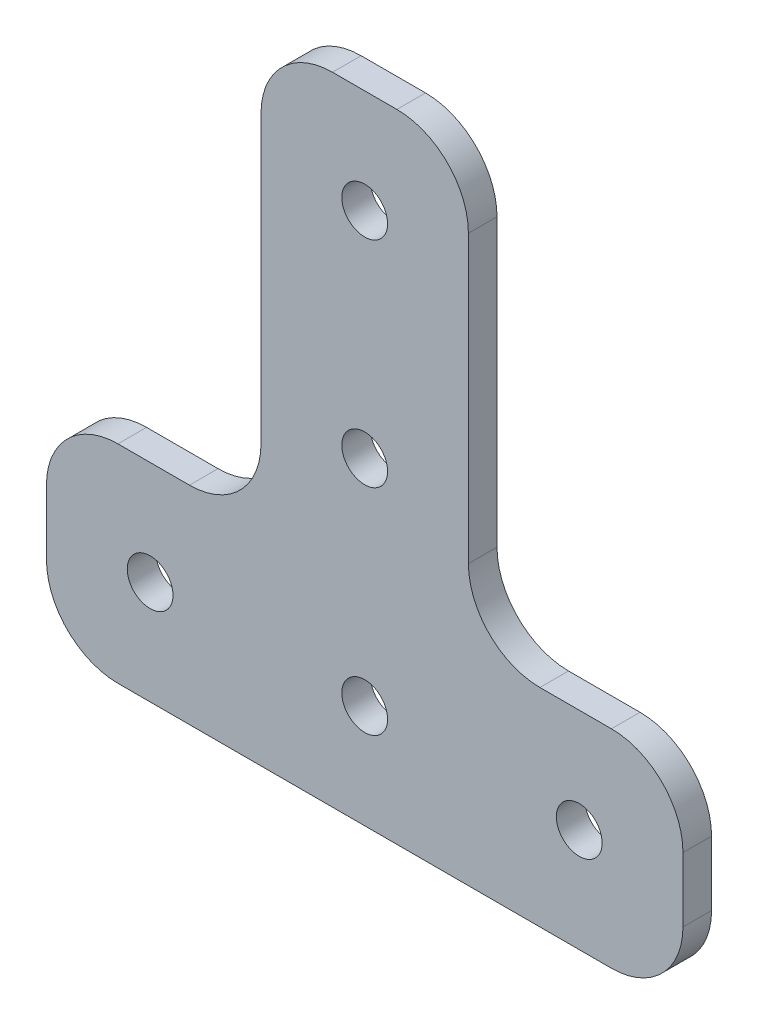
ISO-10303-21;
HEADER;
FILE_DESCRIPTION(('STEP AP214'),'2;1');
FILE_NAME('part.step','',(''),(''),'','','');
FILE_SCHEMA(('AUTOMOTIVE_DESIGN { 1 0 10303 214 1 1 1 1 }'));
ENDSEC;
DATA;
#1=APPLICATION_CONTEXT('core data for automotive mechanical design processes');
#2=APPLICATION_PROTOCOL_DEFINITION('international standard','automotive_design',2000,#1);
#3=PRODUCT_CONTEXT('',#1,'mechanical');
#4=PRODUCT('Part','Part','',(#3));
#5=PRODUCT_RELATED_PRODUCT_CATEGORY('part','',(#4));
#6=PRODUCT_DEFINITION_FORMATION('','',#4);
#7=PRODUCT_DEFINITION_CONTEXT('part definition',#1,'design');
#8=PRODUCT_DEFINITION('design','',#6,#7);
#9=PRODUCT_DEFINITION_SHAPE('','',#8);
#10=(LENGTH_UNIT() NAMED_UNIT(*) SI_UNIT(.MILLI.,.METRE.));
#11=(NAMED_UNIT(*) PLANE_ANGLE_UNIT() SI_UNIT($,.RADIAN.));
#12=(NAMED_UNIT(*) SI_UNIT($,.STERADIAN.) SOLID_ANGLE_UNIT());
#13=UNCERTAINTY_MEASURE_WITH_UNIT(LENGTH_MEASURE(1.E-05),#10,'distance_accuracy_value','');
#14=(GEOMETRIC_REPRESENTATION_CONTEXT(3) GLOBAL_UNCERTAINTY_ASSIGNED_CONTEXT((#13)) GLOBAL_UNIT_ASSIGNED_CONTEXT((#10,
#11,#12)) REPRESENTATION_CONTEXT('',''));
#15=CARTESIAN_POINT('',(0.,0.,0.));
#16=DIRECTION('',(0.,0.,1.));
#17=DIRECTION('',(1.,0.,0.));
#18=AXIS2_PLACEMENT_3D('',#15,#16,#17);
#19=CARTESIAN_POINT('',(0.,0.,2.));
#20=DIRECTION('',(0.,0.,1.));
#21=DIRECTION('',(1.,0.,0.));
#22=AXIS2_PLACEMENT_3D('',#19,#20,#21);
#23=PLANE('',#22);
#24=CARTESIAN_POINT('',(0.,37.25,2.));
#25=DIRECTION('',(0.,0.,1.));
#26=DIRECTION('',(1.,0.,0.));
#27=AXIS2_PLACEMENT_3D('',#24,#25,#26);
#28=CIRCLE('',#27,1.6);
#29=CARTESIAN_POINT('',(1.6,37.25,2.));
#30=VERTEX_POINT('',#29);
#31=EDGE_CURVE('E541',#30,#30,#28,.T.);
#32=ORIENTED_EDGE('',*,*,#31,.F.);
#33=EDGE_LOOP('',(#32));
#34=FACE_BOUND('',#33,.T.);
#35=CARTESIAN_POINT('',(15.,7.25,2.));
#36=DIRECTION('',(0.,0.,1.));
#37=DIRECTION('',(1.,0.,0.));
#38=AXIS2_PLACEMENT_3D('',#35,#36,#37);
#39=CIRCLE('',#38,1.6);
#40=CARTESIAN_POINT('',(16.6,7.25,2.));
#41=VERTEX_POINT('',#40);
#42=EDGE_CURVE('E521',#41,#41,#39,.T.);
#43=ORIENTED_EDGE('',*,*,#42,.F.);
#44=EDGE_LOOP('',(#43));
#45=FACE_BOUND('',#44,.T.);
#46=DIRECTION('',(-1.,0.,0.));
#47=VECTOR('',#46,1.);
#48=CARTESIAN_POINT('',(-7.24999999999999,44.5,2.));
#49=LINE('',#48,#47);
#50=CARTESIAN_POINT('',(2.25,44.5,2.));
#51=VERTEX_POINT('',#50);
#52=CARTESIAN_POINT('',(-2.24999999999999,44.5,2.));
#53=VERTEX_POINT('',#52);
#54=EDGE_CURVE('E280',#51,#53,#49,.T.);
#55=ORIENTED_EDGE('',*,*,#54,.T.);
#56=CARTESIAN_POINT('',(-2.24999999999999,39.5,2.));
#57=DIRECTION('',(0.,0.,1.));
#58=DIRECTION('',(1.,0.,0.));
#59=AXIS2_PLACEMENT_3D('',#56,#57,#58);
#60=CIRCLE('',#59,5.);
#61=CARTESIAN_POINT('',(-7.24999999999999,39.5,2.));
#62=VERTEX_POINT('',#61);
#63=EDGE_CURVE('E239',#53,#62,#60,.T.);
#64=ORIENTED_EDGE('',*,*,#63,.T.);
#65=DIRECTION('',(0.,-1.,0.));
#66=VECTOR('',#65,1.);
#67=CARTESIAN_POINT('',(-7.24999999999999,44.5,2.));
#68=LINE('',#67,#66);
#69=CARTESIAN_POINT('',(-7.25,19.5,2.));
#70=VERTEX_POINT('',#69);
#71=EDGE_CURVE('E271',#62,#70,#68,.T.);
#72=ORIENTED_EDGE('',*,*,#71,.T.);
#73=CARTESIAN_POINT('',(-12.25,19.5,2.));
#74=DIRECTION('',(0.,0.,1.));
#75=DIRECTION('',(1.,0.,0.));
#76=AXIS2_PLACEMENT_3D('',#73,#74,#75);
#77=CIRCLE('',#76,5.);
#78=CARTESIAN_POINT('',(-12.25,14.5,2.));
#79=VERTEX_POINT('',#78);
#80=EDGE_CURVE('E11',#70,#79,#77,.F.);
#81=ORIENTED_EDGE('',*,*,#80,.T.);
#82=DIRECTION('',(-1.,0.,0.));
#83=VECTOR('',#82,1.);
#84=CARTESIAN_POINT('',(-22.25,14.5,2.));
#85=LINE('',#84,#83);
#86=CARTESIAN_POINT('',(-17.25,14.5,2.));
#87=VERTEX_POINT('',#86);
#88=EDGE_CURVE('E269',#79,#87,#85,.T.);
#89=ORIENTED_EDGE('',*,*,#88,.T.);
#90=CARTESIAN_POINT('',(-17.25,9.5,2.));
#91=DIRECTION('',(0.,0.,1.));
#92=DIRECTION('',(1.,0.,0.));
#93=AXIS2_PLACEMENT_3D('',#90,#91,#92);
#94=CIRCLE('',#93,5.);
#95=CARTESIAN_POINT('',(-22.25,9.5,2.));
#96=VERTEX_POINT('',#95);
#97=EDGE_CURVE('E230',#87,#96,#94,.T.);
#98=ORIENTED_EDGE('',*,*,#97,.T.);
#99=DIRECTION('',(0.,-1.,0.));
#100=VECTOR('',#99,1.);
#101=CARTESIAN_POINT('',(-22.25,0.,2.));
#102=LINE('',#101,#100);
#103=CARTESIAN_POINT('',(-22.25,5.,2.));
#104=VERTEX_POINT('',#103);
#105=EDGE_CURVE('E275',#96,#104,#102,.T.);
#106=ORIENTED_EDGE('',*,*,#105,.T.);
#107=CARTESIAN_POINT('',(-17.25,5.,2.));
#108=DIRECTION('',(0.,0.,1.));
#109=DIRECTION('',(1.,0.,0.));
#110=AXIS2_PLACEMENT_3D('',#107,#108,#109);
#111=CIRCLE('',#110,5.);
#112=CARTESIAN_POINT('',(-17.25,0.,2.));
#113=VERTEX_POINT('',#112);
#114=EDGE_CURVE('E232',#104,#113,#111,.T.);
#115=ORIENTED_EDGE('',*,*,#114,.T.);
#116=DIRECTION('',(1.,0.,0.));
#117=VECTOR('',#116,1.);
#118=CARTESIAN_POINT('',(-22.25,0.,2.));
#119=LINE('',#118,#117);
#120=CARTESIAN_POINT('',(17.25,0.,2.));
#121=VERTEX_POINT('',#120);
#122=EDGE_CURVE('E278',#113,#121,#119,.T.);
#123=ORIENTED_EDGE('',*,*,#122,.T.);
#124=CARTESIAN_POINT('',(17.25,5.,2.));
#125=DIRECTION('',(0.,0.,1.));
#126=DIRECTION('',(1.,0.,0.));
#127=AXIS2_PLACEMENT_3D('',#124,#125,#126);
#128=CIRCLE('',#127,5.);
#129=CARTESIAN_POINT('',(22.25,5.,2.));
#130=VERTEX_POINT('',#129);
#131=EDGE_CURVE('E54',#121,#130,#128,.T.);
#132=ORIENTED_EDGE('',*,*,#131,.T.);
#133=DIRECTION('',(0.,1.,0.));
#134=VECTOR('',#133,1.);
#135=CARTESIAN_POINT('',(22.25,0.,2.));
#136=LINE('',#135,#134);
#137=CARTESIAN_POINT('',(22.25,9.5,2.));
#138=VERTEX_POINT('',#137);
#139=EDGE_CURVE('E199',#130,#138,#136,.T.);
#140=ORIENTED_EDGE('',*,*,#139,.T.);
#141=CARTESIAN_POINT('',(17.25,9.5,2.));
#142=DIRECTION('',(0.,0.,1.));
#143=DIRECTION('',(1.,0.,0.));
#144=AXIS2_PLACEMENT_3D('',#141,#142,#143);
#145=CIRCLE('',#144,5.);
#146=CARTESIAN_POINT('',(17.25,14.5,2.));
#147=VERTEX_POINT('',#146);
#148=EDGE_CURVE('E234',#138,#147,#145,.T.);
#149=ORIENTED_EDGE('',*,*,#148,.T.);
#150=DIRECTION('',(-1.,0.,0.));
#151=VECTOR('',#150,1.);
#152=CARTESIAN_POINT('',(7.25000000000001,14.5,2.));
#153=LINE('',#152,#151);
#154=CARTESIAN_POINT('',(12.25,14.5,2.));
#155=VERTEX_POINT('',#154);
#156=EDGE_CURVE('E198',#147,#155,#153,.T.);
#157=ORIENTED_EDGE('',*,*,#156,.T.);
#158=CARTESIAN_POINT('',(12.25,19.5,2.));
#159=DIRECTION('',(0.,0.,1.));
#160=DIRECTION('',(1.,0.,0.));
#161=AXIS2_PLACEMENT_3D('',#158,#159,#160);
#162=CIRCLE('',#161,5.);
#163=CARTESIAN_POINT('',(7.25000000000001,19.5,2.));
#164=VERTEX_POINT('',#163);
#165=EDGE_CURVE('E156',#155,#164,#162,.F.);
#166=ORIENTED_EDGE('',*,*,#165,.T.);
#167=DIRECTION('',(0.,1.,0.));
#168=VECTOR('',#167,1.);
#169=CARTESIAN_POINT('',(7.25,44.5,2.));
#170=LINE('',#169,#168);
#171=CARTESIAN_POINT('',(7.25,39.5,2.));
#172=VERTEX_POINT('',#171);
#173=EDGE_CURVE('E166',#164,#172,#170,.T.);
#174=ORIENTED_EDGE('',*,*,#173,.T.);
#175=CARTESIAN_POINT('',(2.25,39.5,2.));
#176=DIRECTION('',(0.,0.,1.));
#177=DIRECTION('',(1.,0.,0.));
#178=AXIS2_PLACEMENT_3D('',#175,#176,#177);
#179=CIRCLE('',#178,5.);
#180=EDGE_CURVE('E237',#172,#51,#179,.T.);
#181=ORIENTED_EDGE('',*,*,#180,.T.);
#182=EDGE_LOOP('',(#55,#64,#72,#81,#89,#98,#106,#115,#123,#132,#140,#149,#157,#166,#174,#181));
#183=FACE_BOUND('',#182,.T.);
#184=CARTESIAN_POINT('',(0.,7.25,2.));
#185=DIRECTION('',(0.,0.,1.));
#186=DIRECTION('',(1.,0.,0.));
#187=AXIS2_PLACEMENT_3D('',#184,#185,#186);
#188=CIRCLE('',#187,1.6);
#189=CARTESIAN_POINT('',(1.60000000000001,7.25,2.));
#190=VERTEX_POINT('',#189);
#191=EDGE_CURVE('E181',#190,#190,#188,.T.);
#192=ORIENTED_EDGE('',*,*,#191,.F.);
#193=EDGE_LOOP('',(#192));
#194=FACE_BOUND('',#193,.T.);
#195=CARTESIAN_POINT('',(0.,22.25,2.));
#196=DIRECTION('',(0.,0.,1.));
#197=DIRECTION('',(1.,0.,0.));
#198=AXIS2_PLACEMENT_3D('',#195,#196,#197);
#199=CIRCLE('',#198,1.6);
#200=CARTESIAN_POINT('',(1.60000000000001,22.25,2.));
#201=VERTEX_POINT('',#200);
#202=EDGE_CURVE('E536',#201,#201,#199,.T.);
#203=ORIENTED_EDGE('',*,*,#202,.F.);
#204=EDGE_LOOP('',(#203));
#205=FACE_BOUND('',#204,.T.);
#206=CARTESIAN_POINT('',(-15.,7.25,2.));
#207=DIRECTION('',(0.,0.,1.));
#208=DIRECTION('',(-1.,0.,0.));
#209=AXIS2_PLACEMENT_3D('',#206,#207,#208);
#210=CIRCLE('',#209,1.6);
#211=CARTESIAN_POINT('',(-16.6,7.25,2.));
#212=VERTEX_POINT('',#211);
#213=EDGE_CURVE('E547',#212,#212,#210,.T.);
#214=ORIENTED_EDGE('',*,*,#213,.F.);
#215=EDGE_LOOP('',(#214));
#216=FACE_BOUND('',#215,.T.);
#217=ADVANCED_FACE('F32',(#34,#45,#183,#194,#205,#216),#23,.T.);
#218=CARTESIAN_POINT('',(0.,0.,0.));
#219=DIRECTION('',(0.,0.,1.));
#220=DIRECTION('',(1.,0.,0.));
#221=AXIS2_PLACEMENT_3D('',#218,#219,#220);
#222=PLANE('',#221);
#223=CARTESIAN_POINT('',(0.,37.25,0.));
#224=DIRECTION('',(0.,0.,1.));
#225=DIRECTION('',(1.,0.,0.));
#226=AXIS2_PLACEMENT_3D('',#223,#224,#225);
#227=CIRCLE('',#226,1.6);
#228=CARTESIAN_POINT('',(1.6,37.25,0.));
#229=VERTEX_POINT('',#228);
#230=EDGE_CURVE('E544',#229,#229,#227,.T.);
#231=ORIENTED_EDGE('',*,*,#230,.T.);
#232=EDGE_LOOP('',(#231));
#233=FACE_BOUND('',#232,.T.);
#234=CARTESIAN_POINT('',(15.,7.25,0.));
#235=DIRECTION('',(0.,0.,1.));
#236=DIRECTION('',(1.,0.,0.));
#237=AXIS2_PLACEMENT_3D('',#234,#235,#236);
#238=CIRCLE('',#237,1.6);
#239=CARTESIAN_POINT('',(16.6,7.25,0.));
#240=VERTEX_POINT('',#239);
#241=EDGE_CURVE('E525',#240,#240,#238,.T.);
#242=ORIENTED_EDGE('',*,*,#241,.T.);
#243=EDGE_LOOP('',(#242));
#244=FACE_BOUND('',#243,.T.);
#245=DIRECTION('',(0.,-1.,0.));
#246=VECTOR('',#245,1.);
#247=CARTESIAN_POINT('',(-7.24999999999999,44.5,0.));
#248=LINE('',#247,#246);
#249=CARTESIAN_POINT('',(-7.24999999999999,39.5,0.));
#250=VERTEX_POINT('',#249);
#251=CARTESIAN_POINT('',(-7.25,19.5,0.));
#252=VERTEX_POINT('',#251);
#253=EDGE_CURVE('E179',#250,#252,#248,.T.);
#254=ORIENTED_EDGE('',*,*,#253,.F.);
#255=CARTESIAN_POINT('',(-2.24999999999999,39.5,0.));
#256=DIRECTION('',(0.,0.,1.));
#257=DIRECTION('',(1.,0.,0.));
#258=AXIS2_PLACEMENT_3D('',#255,#256,#257);
#259=CIRCLE('',#258,5.);
#260=CARTESIAN_POINT('',(-2.24999999999999,44.5,0.));
#261=VERTEX_POINT('',#260);
#262=EDGE_CURVE('E223',#250,#261,#259,.F.);
#263=ORIENTED_EDGE('',*,*,#262,.T.);
#264=DIRECTION('',(-1.,0.,0.));
#265=VECTOR('',#264,1.);
#266=CARTESIAN_POINT('',(-7.24999999999999,44.5,0.));
#267=LINE('',#266,#265);
#268=CARTESIAN_POINT('',(2.25,44.5,0.));
#269=VERTEX_POINT('',#268);
#270=EDGE_CURVE('E175',#269,#261,#267,.T.);
#271=ORIENTED_EDGE('',*,*,#270,.F.);
#272=CARTESIAN_POINT('',(2.25,39.5,0.));
#273=DIRECTION('',(0.,0.,1.));
#274=DIRECTION('',(1.,0.,0.));
#275=AXIS2_PLACEMENT_3D('',#272,#273,#274);
#276=CIRCLE('',#275,5.);
#277=CARTESIAN_POINT('',(7.25,39.5,0.));
#278=VERTEX_POINT('',#277);
#279=EDGE_CURVE('E174',#269,#278,#276,.F.);
#280=ORIENTED_EDGE('',*,*,#279,.T.);
#281=DIRECTION('',(0.,1.,0.));
#282=VECTOR('',#281,1.);
#283=CARTESIAN_POINT('',(7.25,44.5,0.));
#284=LINE('',#283,#282);
#285=CARTESIAN_POINT('',(7.25000000000001,19.5,0.));
#286=VERTEX_POINT('',#285);
#287=EDGE_CURVE('E163',#286,#278,#284,.T.);
#288=ORIENTED_EDGE('',*,*,#287,.F.);
#289=CARTESIAN_POINT('',(12.25,19.5,0.));
#290=DIRECTION('',(0.,0.,1.));
#291=DIRECTION('',(1.,0.,0.));
#292=AXIS2_PLACEMENT_3D('',#289,#290,#291);
#293=CIRCLE('',#292,5.);
#294=CARTESIAN_POINT('',(12.25,14.5,0.));
#295=VERTEX_POINT('',#294);
#296=EDGE_CURVE('E146',#286,#295,#293,.T.);
#297=ORIENTED_EDGE('',*,*,#296,.T.);
#298=DIRECTION('',(-1.,0.,0.));
#299=VECTOR('',#298,1.);
#300=CARTESIAN_POINT('',(7.25000000000001,14.5,0.));
#301=LINE('',#300,#299);
#302=CARTESIAN_POINT('',(17.25,14.5,0.));
#303=VERTEX_POINT('',#302);
#304=EDGE_CURVE('E176',#303,#295,#301,.T.);
#305=ORIENTED_EDGE('',*,*,#304,.F.);
#306=CARTESIAN_POINT('',(17.25,9.5,0.));
#307=DIRECTION('',(0.,0.,1.));
#308=DIRECTION('',(1.,0.,0.));
#309=AXIS2_PLACEMENT_3D('',#306,#307,#308);
#310=CIRCLE('',#309,5.);
#311=CARTESIAN_POINT('',(22.25,9.5,0.));
#312=VERTEX_POINT('',#311);
#313=EDGE_CURVE('E218',#303,#312,#310,.F.);
#314=ORIENTED_EDGE('',*,*,#313,.T.);
#315=DIRECTION('',(0.,1.,0.));
#316=VECTOR('',#315,1.);
#317=CARTESIAN_POINT('',(22.25,0.,0.));
#318=LINE('',#317,#316);
#319=CARTESIAN_POINT('',(22.25,5.,0.));
#320=VERTEX_POINT('',#319);
#321=EDGE_CURVE('E196',#320,#312,#318,.T.);
#322=ORIENTED_EDGE('',*,*,#321,.F.);
#323=CARTESIAN_POINT('',(17.25,5.,0.));
#324=DIRECTION('',(0.,0.,1.));
#325=DIRECTION('',(1.,0.,0.));
#326=AXIS2_PLACEMENT_3D('',#323,#324,#325);
#327=CIRCLE('',#326,5.);
#328=CARTESIAN_POINT('',(17.25,0.,0.));
#329=VERTEX_POINT('',#328);
#330=EDGE_CURVE('E220',#320,#329,#327,.F.);
#331=ORIENTED_EDGE('',*,*,#330,.T.);
#332=DIRECTION('',(1.,0.,0.));
#333=VECTOR('',#332,1.);
#334=CARTESIAN_POINT('',(-22.25,0.,0.));
#335=LINE('',#334,#333);
#336=CARTESIAN_POINT('',(-17.25,0.,0.));
#337=VERTEX_POINT('',#336);
#338=EDGE_CURVE('E193',#337,#329,#335,.T.);
#339=ORIENTED_EDGE('',*,*,#338,.F.);
#340=CARTESIAN_POINT('',(-17.25,5.,0.));
#341=DIRECTION('',(0.,0.,1.));
#342=DIRECTION('',(1.,0.,0.));
#343=AXIS2_PLACEMENT_3D('',#340,#341,#342);
#344=CIRCLE('',#343,5.);
#345=CARTESIAN_POINT('',(-22.25,5.,0.));
#346=VERTEX_POINT('',#345);
#347=EDGE_CURVE('E216',#337,#346,#344,.F.);
#348=ORIENTED_EDGE('',*,*,#347,.T.);
#349=DIRECTION('',(0.,-1.,0.));
#350=VECTOR('',#349,1.);
#351=CARTESIAN_POINT('',(-22.25,0.,0.));
#352=LINE('',#351,#350);
#353=CARTESIAN_POINT('',(-22.25,9.5,0.));
#354=VERTEX_POINT('',#353);
#355=EDGE_CURVE('E190',#354,#346,#352,.T.);
#356=ORIENTED_EDGE('',*,*,#355,.F.);
#357=CARTESIAN_POINT('',(-17.25,9.5,0.));
#358=DIRECTION('',(0.,0.,1.));
#359=DIRECTION('',(1.,0.,0.));
#360=AXIS2_PLACEMENT_3D('',#357,#358,#359);
#361=CIRCLE('',#360,5.);
#362=CARTESIAN_POINT('',(-17.25,14.5,0.));
#363=VERTEX_POINT('',#362);
#364=EDGE_CURVE('E214',#354,#363,#361,.F.);
#365=ORIENTED_EDGE('',*,*,#364,.T.);
#366=DIRECTION('',(-1.,0.,0.));
#367=VECTOR('',#366,1.);
#368=CARTESIAN_POINT('',(-22.25,14.5,0.));
#369=LINE('',#368,#367);
#370=CARTESIAN_POINT('',(-12.25,14.5,0.));
#371=VERTEX_POINT('',#370);
#372=EDGE_CURVE('E187',#371,#363,#369,.T.);
#373=ORIENTED_EDGE('',*,*,#372,.F.);
#374=CARTESIAN_POINT('',(-12.25,19.5,0.));
#375=DIRECTION('',(0.,0.,1.));
#376=DIRECTION('',(1.,0.,0.));
#377=AXIS2_PLACEMENT_3D('',#374,#375,#376);
#378=CIRCLE('',#377,5.);
#379=EDGE_CURVE('E40',#371,#252,#378,.T.);
#380=ORIENTED_EDGE('',*,*,#379,.T.);
#381=EDGE_LOOP('',(#254,#263,#271,#280,#288,#297,#305,#314,#322,#331,#339,#348,#356,#365,#373,#380));
#382=FACE_BOUND('',#381,.T.);
#383=CARTESIAN_POINT('',(0.,7.25,0.));
#384=DIRECTION('',(0.,0.,1.));
#385=DIRECTION('',(1.,0.,0.));
#386=AXIS2_PLACEMENT_3D('',#383,#384,#385);
#387=CIRCLE('',#386,1.6);
#388=CARTESIAN_POINT('',(1.60000000000001,7.25,0.));
#389=VERTEX_POINT('',#388);
#390=EDGE_CURVE('E520',#389,#389,#387,.T.);
#391=ORIENTED_EDGE('',*,*,#390,.T.);
#392=EDGE_LOOP('',(#391));
#393=FACE_BOUND('',#392,.T.);
#394=CARTESIAN_POINT('',(0.,22.25,0.));
#395=DIRECTION('',(0.,0.,1.));
#396=DIRECTION('',(1.,0.,0.));
#397=AXIS2_PLACEMENT_3D('',#394,#395,#396);
#398=CIRCLE('',#397,1.6);
#399=CARTESIAN_POINT('',(1.60000000000001,22.25,0.));
#400=VERTEX_POINT('',#399);
#401=EDGE_CURVE('E538',#400,#400,#398,.T.);
#402=ORIENTED_EDGE('',*,*,#401,.T.);
#403=EDGE_LOOP('',(#402));
#404=FACE_BOUND('',#403,.T.);
#405=CARTESIAN_POINT('',(-15.,7.25,0.));
#406=DIRECTION('',(0.,0.,1.));
#407=DIRECTION('',(-1.,0.,0.));
#408=AXIS2_PLACEMENT_3D('',#405,#406,#407);
#409=CIRCLE('',#408,1.6);
#410=CARTESIAN_POINT('',(-16.6,7.25,0.));
#411=VERTEX_POINT('',#410);
#412=EDGE_CURVE('E550',#411,#411,#409,.T.);
#413=ORIENTED_EDGE('',*,*,#412,.T.);
#414=EDGE_LOOP('',(#413));
#415=FACE_BOUND('',#414,.T.);
#416=ADVANCED_FACE('F171',(#233,#244,#382,#393,#404,#415),#222,.F.);
#417=CARTESIAN_POINT('',(7.25000000000001,14.5,2.));
#418=DIRECTION('',(0.,-1.,0.));
#419=DIRECTION('',(0.,0.,-1.));
#420=AXIS2_PLACEMENT_3D('',#417,#418,#419);
#421=PLANE('',#420);
#422=ORIENTED_EDGE('',*,*,#304,.T.);
#423=DIRECTION('',(0.,0.,-1.));
#424=VECTOR('',#423,1.);
#425=CARTESIAN_POINT('',(12.25,14.5,2.));
#426=LINE('',#425,#424);
#427=EDGE_CURVE('E151',#295,#155,#426,.F.);
#428=ORIENTED_EDGE('',*,*,#427,.T.);
#429=ORIENTED_EDGE('',*,*,#156,.F.);
#430=DIRECTION('',(0.,0.,-1.));
#431=VECTOR('',#430,1.);
#432=CARTESIAN_POINT('',(17.25,14.5,2.));
#433=LINE('',#432,#431);
#434=EDGE_CURVE('E167',#147,#303,#433,.T.);
#435=ORIENTED_EDGE('',*,*,#434,.T.);
#436=EDGE_LOOP('',(#422,#428,#429,#435));
#437=FACE_BOUND('',#436,.T.);
#438=ADVANCED_FACE('F292',(#437),#421,.F.);
#439=CARTESIAN_POINT('',(7.25,44.5,2.));
#440=DIRECTION('',(-1.,0.,0.));
#441=DIRECTION('',(0.,-1.,0.));
#442=AXIS2_PLACEMENT_3D('',#439,#440,#441);
#443=PLANE('',#442);
#444=ORIENTED_EDGE('',*,*,#173,.F.);
#445=DIRECTION('',(0.,0.,-1.));
#446=VECTOR('',#445,1.);
#447=CARTESIAN_POINT('',(7.25000000000001,19.5,0.));
#448=LINE('',#447,#446);
#449=EDGE_CURVE('E150',#164,#286,#448,.T.);
#450=ORIENTED_EDGE('',*,*,#449,.T.);
#451=ORIENTED_EDGE('',*,*,#287,.T.);
#452=DIRECTION('',(0.,0.,-1.));
#453=VECTOR('',#452,1.);
#454=CARTESIAN_POINT('',(7.25,39.5,2.));
#455=LINE('',#454,#453);
#456=EDGE_CURVE('E168',#278,#172,#455,.F.);
#457=ORIENTED_EDGE('',*,*,#456,.T.);
#458=EDGE_LOOP('',(#444,#450,#451,#457));
#459=FACE_BOUND('',#458,.T.);
#460=ADVANCED_FACE('F162',(#459),#443,.F.);
#461=CARTESIAN_POINT('',(-7.24999999999999,44.5,2.));
#462=DIRECTION('',(0.,-1.,0.));
#463=DIRECTION('',(0.,0.,-1.));
#464=AXIS2_PLACEMENT_3D('',#461,#462,#463);
#465=PLANE('',#464);
#466=ORIENTED_EDGE('',*,*,#270,.T.);
#467=DIRECTION('',(0.,0.,-1.));
#468=VECTOR('',#467,1.);
#469=CARTESIAN_POINT('',(-2.24999999999999,44.5,2.));
#470=LINE('',#469,#468);
#471=EDGE_CURVE('E228',#261,#53,#470,.F.);
#472=ORIENTED_EDGE('',*,*,#471,.T.);
#473=ORIENTED_EDGE('',*,*,#54,.F.);
#474=DIRECTION('',(0.,0.,-1.));
#475=VECTOR('',#474,1.);
#476=CARTESIAN_POINT('',(2.25,44.5,2.));
#477=LINE('',#476,#475);
#478=EDGE_CURVE('E225',#51,#269,#477,.T.);
#479=ORIENTED_EDGE('',*,*,#478,.T.);
#480=EDGE_LOOP('',(#466,#472,#473,#479));
#481=FACE_BOUND('',#480,.T.);
#482=ADVANCED_FACE('F341',(#481),#465,.F.);
#483=CARTESIAN_POINT('',(-7.24999999999999,44.5,2.));
#484=DIRECTION('',(1.,0.,0.));
#485=DIRECTION('',(0.,1.,0.));
#486=AXIS2_PLACEMENT_3D('',#483,#484,#485);
#487=PLANE('',#486);
#488=ORIENTED_EDGE('',*,*,#253,.T.);
#489=DIRECTION('',(0.,0.,-1.));
#490=VECTOR('',#489,1.);
#491=CARTESIAN_POINT('',(-7.25,19.5,2.));
#492=LINE('',#491,#490);
#493=EDGE_CURVE('E212',#252,#70,#492,.F.);
#494=ORIENTED_EDGE('',*,*,#493,.T.);
#495=ORIENTED_EDGE('',*,*,#71,.F.);
#496=DIRECTION('',(0.,0.,-1.));
#497=VECTOR('',#496,1.);
#498=CARTESIAN_POINT('',(-7.24999999999999,39.5,2.));
#499=LINE('',#498,#497);
#500=EDGE_CURVE('E209',#62,#250,#499,.T.);
#501=ORIENTED_EDGE('',*,*,#500,.T.);
#502=EDGE_LOOP('',(#488,#494,#495,#501));
#503=FACE_BOUND('',#502,.T.);
#504=ADVANCED_FACE('F259',(#503),#487,.F.);
#505=CARTESIAN_POINT('',(-22.25,14.5,2.));
#506=DIRECTION('',(0.,-1.,0.));
#507=DIRECTION('',(1.,0.,0.));
#508=AXIS2_PLACEMENT_3D('',#505,#506,#507);
#509=PLANE('',#508);
#510=ORIENTED_EDGE('',*,*,#88,.F.);
#511=DIRECTION('',(0.,0.,-1.));
#512=VECTOR('',#511,1.);
#513=CARTESIAN_POINT('',(-12.25,14.5,0.));
#514=LINE('',#513,#512);
#515=EDGE_CURVE('E206',#79,#371,#514,.T.);
#516=ORIENTED_EDGE('',*,*,#515,.T.);
#517=ORIENTED_EDGE('',*,*,#372,.T.);
#518=DIRECTION('',(0.,0.,-1.));
#519=VECTOR('',#518,1.);
#520=CARTESIAN_POINT('',(-17.25,14.5,2.));
#521=LINE('',#520,#519);
#522=EDGE_CURVE('E204',#363,#87,#521,.F.);
#523=ORIENTED_EDGE('',*,*,#522,.T.);
#524=EDGE_LOOP('',(#510,#516,#517,#523));
#525=FACE_BOUND('',#524,.T.);
#526=ADVANCED_FACE('F273',(#525),#509,.F.);
#527=CARTESIAN_POINT('',(-22.25,0.,2.));
#528=DIRECTION('',(1.,0.,0.));
#529=DIRECTION('',(0.,0.,-1.));
#530=AXIS2_PLACEMENT_3D('',#527,#528,#529);
#531=PLANE('',#530);
#532=ORIENTED_EDGE('',*,*,#355,.T.);
#533=DIRECTION('',(0.,0.,-1.));
#534=VECTOR('',#533,1.);
#535=CARTESIAN_POINT('',(-22.25,5.,2.));
#536=LINE('',#535,#534);
#537=EDGE_CURVE('E157',#346,#104,#536,.F.);
#538=ORIENTED_EDGE('',*,*,#537,.T.);
#539=ORIENTED_EDGE('',*,*,#105,.F.);
#540=DIRECTION('',(0.,0.,-1.));
#541=VECTOR('',#540,1.);
#542=CARTESIAN_POINT('',(-22.25,9.5,2.));
#543=LINE('',#542,#541);
#544=EDGE_CURVE('E250',#96,#354,#543,.T.);
#545=ORIENTED_EDGE('',*,*,#544,.T.);
#546=EDGE_LOOP('',(#532,#538,#539,#545));
#547=FACE_BOUND('',#546,.T.);
#548=ADVANCED_FACE('F309',(#547),#531,.F.);
#549=CARTESIAN_POINT('',(-22.25,0.,2.));
#550=DIRECTION('',(0.,1.,0.));
#551=DIRECTION('',(-1.,0.,0.));
#552=AXIS2_PLACEMENT_3D('',#549,#550,#551);
#553=PLANE('',#552);
#554=ORIENTED_EDGE('',*,*,#338,.T.);
#555=DIRECTION('',(0.,0.,-1.));
#556=VECTOR('',#555,1.);
#557=CARTESIAN_POINT('',(17.25,0.,2.));
#558=LINE('',#557,#556);
#559=EDGE_CURVE('E248',#329,#121,#558,.F.);
#560=ORIENTED_EDGE('',*,*,#559,.T.);
#561=ORIENTED_EDGE('',*,*,#122,.F.);
#562=DIRECTION('',(0.,0.,-1.));
#563=VECTOR('',#562,1.);
#564=CARTESIAN_POINT('',(-17.25,0.,2.));
#565=LINE('',#564,#563);
#566=EDGE_CURVE('E245',#113,#337,#565,.T.);
#567=ORIENTED_EDGE('',*,*,#566,.T.);
#568=EDGE_LOOP('',(#554,#560,#561,#567));
#569=FACE_BOUND('',#568,.T.);
#570=ADVANCED_FACE('F300',(#569),#553,.F.);
#571=CARTESIAN_POINT('',(22.25,0.,2.));
#572=DIRECTION('',(-1.,0.,0.));
#573=DIRECTION('',(0.,0.,1.));
#574=AXIS2_PLACEMENT_3D('',#571,#572,#573);
#575=PLANE('',#574);
#576=ORIENTED_EDGE('',*,*,#139,.F.);
#577=DIRECTION('',(0.,0.,-1.));
#578=VECTOR('',#577,1.);
#579=CARTESIAN_POINT('',(22.25,5.,2.));
#580=LINE('',#579,#578);
#581=EDGE_CURVE('E242',#130,#320,#580,.T.);
#582=ORIENTED_EDGE('',*,*,#581,.T.);
#583=ORIENTED_EDGE('',*,*,#321,.T.);
#584=DIRECTION('',(0.,0.,-1.));
#585=VECTOR('',#584,1.);
#586=CARTESIAN_POINT('',(22.25,9.5,2.));
#587=LINE('',#586,#585);
#588=EDGE_CURVE('E47',#312,#138,#587,.F.);
#589=ORIENTED_EDGE('',*,*,#588,.T.);
#590=EDGE_LOOP('',(#576,#582,#583,#589));
#591=FACE_BOUND('',#590,.T.);
#592=ADVANCED_FACE('F294',(#591),#575,.F.);
#593=CARTESIAN_POINT('',(0.,7.25,2.));
#594=DIRECTION('',(0.,0.,-1.));
#595=DIRECTION('',(-1.,0.,0.));
#596=AXIS2_PLACEMENT_3D('',#593,#594,#595);
#597=CYLINDRICAL_SURFACE('',#596,1.6);
#598=ORIENTED_EDGE('',*,*,#191,.T.);
#599=EDGE_LOOP('',(#598));
#600=FACE_BOUND('',#599,.T.);
#601=ORIENTED_EDGE('',*,*,#390,.F.);
#602=EDGE_LOOP('',(#601));
#603=FACE_BOUND('',#602,.T.);
#604=ADVANCED_FACE('F328',(#600,#603),#597,.F.);
#605=CARTESIAN_POINT('',(15.,7.25,2.));
#606=DIRECTION('',(0.,0.,-1.));
#607=DIRECTION('',(-1.,0.,0.));
#608=AXIS2_PLACEMENT_3D('',#605,#606,#607);
#609=CYLINDRICAL_SURFACE('',#608,1.6);
#610=ORIENTED_EDGE('',*,*,#42,.T.);
#611=EDGE_LOOP('',(#610));
#612=FACE_BOUND('',#611,.T.);
#613=ORIENTED_EDGE('',*,*,#241,.F.);
#614=EDGE_LOOP('',(#613));
#615=FACE_BOUND('',#614,.T.);
#616=ADVANCED_FACE('F432',(#612,#615),#609,.F.);
#617=CARTESIAN_POINT('',(0.,22.25,2.));
#618=DIRECTION('',(0.,0.,-1.));
#619=DIRECTION('',(-1.,0.,0.));
#620=AXIS2_PLACEMENT_3D('',#617,#618,#619);
#621=CYLINDRICAL_SURFACE('',#620,1.6);
#622=ORIENTED_EDGE('',*,*,#202,.T.);
#623=EDGE_LOOP('',(#622));
#624=FACE_BOUND('',#623,.T.);
#625=ORIENTED_EDGE('',*,*,#401,.F.);
#626=EDGE_LOOP('',(#625));
#627=FACE_BOUND('',#626,.T.);
#628=ADVANCED_FACE('F423',(#624,#627),#621,.F.);
#629=CARTESIAN_POINT('',(0.,37.25,2.));
#630=DIRECTION('',(0.,0.,-1.));
#631=DIRECTION('',(-1.,0.,0.));
#632=AXIS2_PLACEMENT_3D('',#629,#630,#631);
#633=CYLINDRICAL_SURFACE('',#632,1.6);
#634=ORIENTED_EDGE('',*,*,#31,.T.);
#635=EDGE_LOOP('',(#634));
#636=FACE_BOUND('',#635,.T.);
#637=ORIENTED_EDGE('',*,*,#230,.F.);
#638=EDGE_LOOP('',(#637));
#639=FACE_BOUND('',#638,.T.);
#640=ADVANCED_FACE('F414',(#636,#639),#633,.F.);
#641=CARTESIAN_POINT('',(-15.,7.25,2.));
#642=DIRECTION('',(0.,0.,-1.));
#643=DIRECTION('',(-1.,0.,0.));
#644=AXIS2_PLACEMENT_3D('',#641,#642,#643);
#645=CYLINDRICAL_SURFACE('',#644,1.6);
#646=ORIENTED_EDGE('',*,*,#213,.T.);
#647=EDGE_LOOP('',(#646));
#648=FACE_BOUND('',#647,.T.);
#649=ORIENTED_EDGE('',*,*,#412,.F.);
#650=EDGE_LOOP('',(#649));
#651=FACE_BOUND('',#650,.T.);
#652=ADVANCED_FACE('F351',(#648,#651),#645,.F.);
#653=CARTESIAN_POINT('',(12.25,19.5,2.));
#654=DIRECTION('',(0.,0.,1.));
#655=DIRECTION('',(1.,0.,0.));
#656=AXIS2_PLACEMENT_3D('',#653,#654,#655);
#657=CYLINDRICAL_SURFACE('',#656,5.);
#658=ORIENTED_EDGE('',*,*,#165,.F.);
#659=ORIENTED_EDGE('',*,*,#427,.F.);
#660=ORIENTED_EDGE('',*,*,#296,.F.);
#661=ORIENTED_EDGE('',*,*,#449,.F.);
#662=EDGE_LOOP('',(#658,#659,#660,#661));
#663=FACE_BOUND('',#662,.T.);
#664=ADVANCED_FACE('F149',(#663),#657,.F.);
#665=CARTESIAN_POINT('',(-12.25,19.5,2.));
#666=DIRECTION('',(0.,0.,1.));
#667=DIRECTION('',(1.,0.,0.));
#668=AXIS2_PLACEMENT_3D('',#665,#666,#667);
#669=CYLINDRICAL_SURFACE('',#668,5.);
#670=ORIENTED_EDGE('',*,*,#80,.F.);
#671=ORIENTED_EDGE('',*,*,#493,.F.);
#672=ORIENTED_EDGE('',*,*,#379,.F.);
#673=ORIENTED_EDGE('',*,*,#515,.F.);
#674=EDGE_LOOP('',(#670,#671,#672,#673));
#675=FACE_BOUND('',#674,.T.);
#676=ADVANCED_FACE('F264',(#675),#669,.F.);
#677=CARTESIAN_POINT('',(-2.24999999999999,39.5,2.));
#678=DIRECTION('',(0.,0.,-1.));
#679=DIRECTION('',(-1.,0.,0.));
#680=AXIS2_PLACEMENT_3D('',#677,#678,#679);
#681=CYLINDRICAL_SURFACE('',#680,5.);
#682=ORIENTED_EDGE('',*,*,#63,.F.);
#683=ORIENTED_EDGE('',*,*,#471,.F.);
#684=ORIENTED_EDGE('',*,*,#262,.F.);
#685=ORIENTED_EDGE('',*,*,#500,.F.);
#686=EDGE_LOOP('',(#682,#683,#684,#685));
#687=FACE_BOUND('',#686,.T.);
#688=ADVANCED_FACE('F354',(#687),#681,.T.);
#689=CARTESIAN_POINT('',(2.25,39.5,2.));
#690=DIRECTION('',(0.,0.,-1.));
#691=DIRECTION('',(-1.,0.,0.));
#692=AXIS2_PLACEMENT_3D('',#689,#690,#691);
#693=CYLINDRICAL_SURFACE('',#692,5.);
#694=ORIENTED_EDGE('',*,*,#180,.F.);
#695=ORIENTED_EDGE('',*,*,#456,.F.);
#696=ORIENTED_EDGE('',*,*,#279,.F.);
#697=ORIENTED_EDGE('',*,*,#478,.F.);
#698=EDGE_LOOP('',(#694,#695,#696,#697));
#699=FACE_BOUND('',#698,.T.);
#700=ADVANCED_FACE('F357',(#699),#693,.T.);
#701=CARTESIAN_POINT('',(17.25,5.,2.));
#702=DIRECTION('',(0.,0.,-1.));
#703=DIRECTION('',(-1.,0.,0.));
#704=AXIS2_PLACEMENT_3D('',#701,#702,#703);
#705=CYLINDRICAL_SURFACE('',#704,5.);
#706=ORIENTED_EDGE('',*,*,#131,.F.);
#707=ORIENTED_EDGE('',*,*,#559,.F.);
#708=ORIENTED_EDGE('',*,*,#330,.F.);
#709=ORIENTED_EDGE('',*,*,#581,.F.);
#710=EDGE_LOOP('',(#706,#707,#708,#709));
#711=FACE_BOUND('',#710,.T.);
#712=ADVANCED_FACE('F296',(#711),#705,.T.);
#713=CARTESIAN_POINT('',(17.25,9.5,2.));
#714=DIRECTION('',(0.,0.,-1.));
#715=DIRECTION('',(-1.,0.,0.));
#716=AXIS2_PLACEMENT_3D('',#713,#714,#715);
#717=CYLINDRICAL_SURFACE('',#716,5.);
#718=ORIENTED_EDGE('',*,*,#148,.F.);
#719=ORIENTED_EDGE('',*,*,#588,.F.);
#720=ORIENTED_EDGE('',*,*,#313,.F.);
#721=ORIENTED_EDGE('',*,*,#434,.F.);
#722=EDGE_LOOP('',(#718,#719,#720,#721));
#723=FACE_BOUND('',#722,.T.);
#724=ADVANCED_FACE('F290',(#723),#717,.T.);
#725=CARTESIAN_POINT('',(-17.25,5.,2.));
#726=DIRECTION('',(0.,0.,-1.));
#727=DIRECTION('',(-1.,0.,0.));
#728=AXIS2_PLACEMENT_3D('',#725,#726,#727);
#729=CYLINDRICAL_SURFACE('',#728,5.);
#730=ORIENTED_EDGE('',*,*,#114,.F.);
#731=ORIENTED_EDGE('',*,*,#537,.F.);
#732=ORIENTED_EDGE('',*,*,#347,.F.);
#733=ORIENTED_EDGE('',*,*,#566,.F.);
#734=EDGE_LOOP('',(#730,#731,#732,#733));
#735=FACE_BOUND('',#734,.T.);
#736=ADVANCED_FACE('F305',(#735),#729,.T.);
#737=CARTESIAN_POINT('',(-17.25,9.5,2.));
#738=DIRECTION('',(0.,0.,-1.));
#739=DIRECTION('',(-1.,0.,0.));
#740=AXIS2_PLACEMENT_3D('',#737,#738,#739);
#741=CYLINDRICAL_SURFACE('',#740,5.);
#742=ORIENTED_EDGE('',*,*,#97,.F.);
#743=ORIENTED_EDGE('',*,*,#522,.F.);
#744=ORIENTED_EDGE('',*,*,#364,.F.);
#745=ORIENTED_EDGE('',*,*,#544,.F.);
#746=EDGE_LOOP('',(#742,#743,#744,#745));
#747=FACE_BOUND('',#746,.T.);
#748=ADVANCED_FACE('F34',(#747),#741,.T.);
#749=CLOSED_SHELL('',(#217,#416,#438,#460,#482,#504,#526,#548,#570,#592,#604,#616,#628,#640,
#652,#664,#676,#688,#700,#712,#724,#736,#748));
#750=MANIFOLD_SOLID_BREP('B2',#749);
#751=ADVANCED_BREP_SHAPE_REPRESENTATION('',(#18,#750),#14);
#752=SHAPE_DEFINITION_REPRESENTATION(#9,#751);
ENDSEC;
END-ISO-10303-21;
